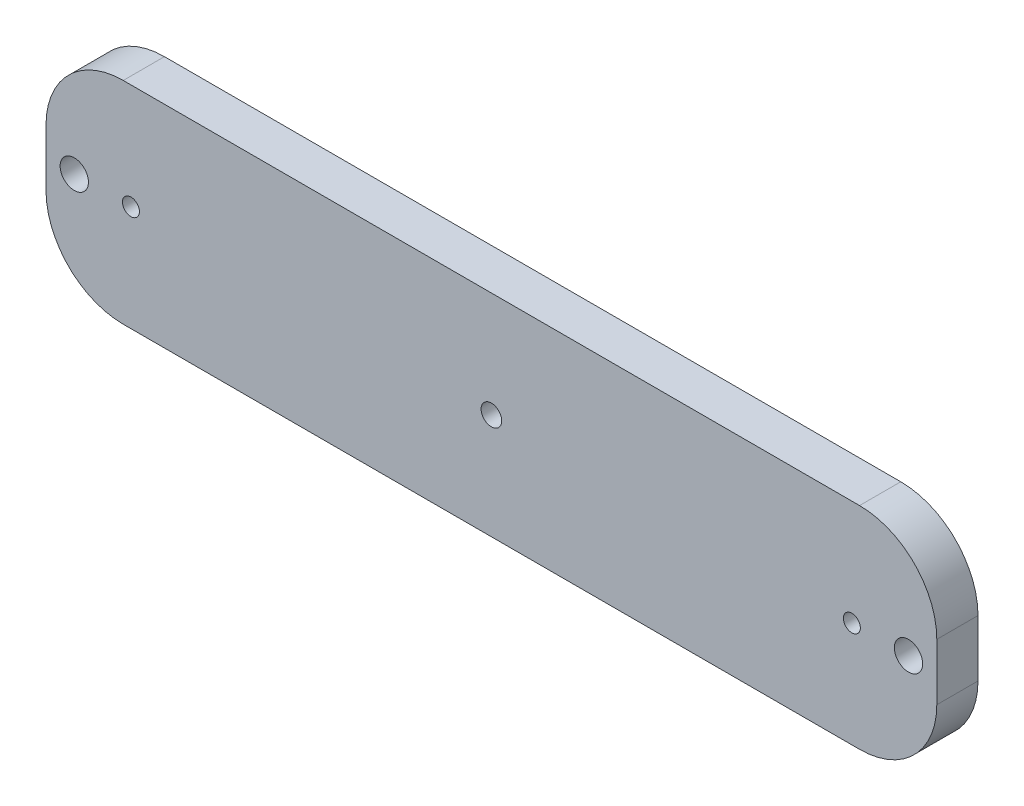
ISO-10303-21;
HEADER;
FILE_DESCRIPTION(('STEP AP214'),'2;1');
FILE_NAME('part.step','',(''),(''),'','','');
FILE_SCHEMA(('AUTOMOTIVE_DESIGN { 1 0 10303 214 1 1 1 1 }'));
ENDSEC;
DATA;
#1=APPLICATION_CONTEXT('core data for automotive mechanical design processes');
#2=APPLICATION_PROTOCOL_DEFINITION('international standard','automotive_design',2000,#1);
#3=PRODUCT_CONTEXT('',#1,'mechanical');
#4=PRODUCT('Part','Part','',(#3));
#5=PRODUCT_RELATED_PRODUCT_CATEGORY('part','',(#4));
#6=PRODUCT_DEFINITION_FORMATION('','',#4);
#7=PRODUCT_DEFINITION_CONTEXT('part definition',#1,'design');
#8=PRODUCT_DEFINITION('design','',#6,#7);
#9=PRODUCT_DEFINITION_SHAPE('','',#8);
#10=(LENGTH_UNIT() NAMED_UNIT(*) SI_UNIT(.MILLI.,.METRE.));
#11=(NAMED_UNIT(*) PLANE_ANGLE_UNIT() SI_UNIT($,.RADIAN.));
#12=(NAMED_UNIT(*) SI_UNIT($,.STERADIAN.) SOLID_ANGLE_UNIT());
#13=UNCERTAINTY_MEASURE_WITH_UNIT(LENGTH_MEASURE(1.E-05),#10,'distance_accuracy_value','');
#14=(GEOMETRIC_REPRESENTATION_CONTEXT(3) GLOBAL_UNCERTAINTY_ASSIGNED_CONTEXT((#13)) GLOBAL_UNIT_ASSIGNED_CONTEXT((#10,
#11,#12)) REPRESENTATION_CONTEXT('',''));
#15=CARTESIAN_POINT('',(0.,0.,0.));
#16=DIRECTION('',(0.,0.,1.));
#17=DIRECTION('',(1.,0.,0.));
#18=AXIS2_PLACEMENT_3D('',#15,#16,#17);
#19=CARTESIAN_POINT('',(138.999999372192,0.,3.));
#20=DIRECTION('',(0.,-1.,0.));
#21=DIRECTION('',(1.,0.,0.));
#22=AXIS2_PLACEMENT_3D('',#19,#20,#21);
#23=PLANE('',#22);
#24=DIRECTION('',(-1.,0.,0.));
#25=VECTOR('',#24,1.);
#26=CARTESIAN_POINT('',(138.999999372192,0.,3.));
#27=LINE('',#26,#25);
#28=CARTESIAN_POINT('',(154.491925357519,0.,3.));
#29=VERTEX_POINT('',#28);
#30=CARTESIAN_POINT('',(11.508074014657,0.,3.));
#31=VERTEX_POINT('',#30);
#32=EDGE_CURVE('E177',#29,#31,#27,.T.);
#33=ORIENTED_EDGE('',*,*,#32,.T.);
#34=DIRECTION('',(0.,0.,1.));
#35=VECTOR('',#34,1.);
#36=CARTESIAN_POINT('',(11.508074014657,0.,3.));
#37=LINE('',#36,#35);
#38=CARTESIAN_POINT('',(11.508074014657,0.,-5.));
#39=VERTEX_POINT('',#38);
#40=EDGE_CURVE('E60',#31,#39,#37,.F.);
#41=ORIENTED_EDGE('',*,*,#40,.T.);
#42=DIRECTION('',(-1.,0.,0.));
#43=VECTOR('',#42,1.);
#44=CARTESIAN_POINT('',(138.999999372192,0.,-5.));
#45=LINE('',#44,#43);
#46=CARTESIAN_POINT('',(154.491925357519,0.,-5.));
#47=VERTEX_POINT('',#46);
#48=EDGE_CURVE('E161',#47,#39,#45,.T.);
#49=ORIENTED_EDGE('',*,*,#48,.F.);
#50=DIRECTION('',(0.,0.,1.));
#51=VECTOR('',#50,1.);
#52=CARTESIAN_POINT('',(154.491925357519,0.,3.));
#53=LINE('',#52,#51);
#54=EDGE_CURVE('E123',#29,#47,#53,.F.);
#55=ORIENTED_EDGE('',*,*,#54,.F.);
#56=EDGE_LOOP('',(#33,#41,#49,#55));
#57=FACE_BOUND('',#56,.T.);
#58=ADVANCED_FACE('F37',(#57),#23,.T.);
#59=CARTESIAN_POINT('',(17.0161480293185,41.,3.));
#60=DIRECTION('',(0.,1.,0.));
#61=DIRECTION('',(-1.,0.,0.));
#62=AXIS2_PLACEMENT_3D('',#59,#60,#61);
#63=PLANE('',#62);
#64=DIRECTION('',(1.,0.,0.));
#65=VECTOR('',#64,1.);
#66=CARTESIAN_POINT('',(17.0161480293185,41.,-5.));
#67=LINE('',#66,#65);
#68=CARTESIAN_POINT('',(11.508074014657,41.,-5.));
#69=VERTEX_POINT('',#68);
#70=CARTESIAN_POINT('',(154.491925357519,41.,-5.));
#71=VERTEX_POINT('',#70);
#72=EDGE_CURVE('E179',#69,#71,#67,.T.);
#73=ORIENTED_EDGE('',*,*,#72,.F.);
#74=DIRECTION('',(0.,0.,1.));
#75=VECTOR('',#74,1.);
#76=CARTESIAN_POINT('',(11.508074014657,41.,3.));
#77=LINE('',#76,#75);
#78=CARTESIAN_POINT('',(11.508074014657,41.,3.));
#79=VERTEX_POINT('',#78);
#80=EDGE_CURVE('E12',#69,#79,#77,.T.);
#81=ORIENTED_EDGE('',*,*,#80,.T.);
#82=DIRECTION('',(1.,0.,0.));
#83=VECTOR('',#82,1.);
#84=CARTESIAN_POINT('',(17.0161480293185,41.,3.));
#85=LINE('',#84,#83);
#86=CARTESIAN_POINT('',(154.491925357519,41.,3.));
#87=VERTEX_POINT('',#86);
#88=EDGE_CURVE('E154',#79,#87,#85,.T.);
#89=ORIENTED_EDGE('',*,*,#88,.T.);
#90=DIRECTION('',(0.,0.,1.));
#91=VECTOR('',#90,1.);
#92=CARTESIAN_POINT('',(154.491925357519,41.,3.));
#93=LINE('',#92,#91);
#94=EDGE_CURVE('E124',#71,#87,#93,.T.);
#95=ORIENTED_EDGE('',*,*,#94,.F.);
#96=EDGE_LOOP('',(#73,#81,#89,#95));
#97=FACE_BOUND('',#96,.T.);
#98=ADVANCED_FACE('F209',(#97),#63,.T.);
#99=CARTESIAN_POINT('',(0.,0.,-5.));
#100=DIRECTION('',(0.,0.,1.));
#101=DIRECTION('',(1.,0.,0.));
#102=AXIS2_PLACEMENT_3D('',#99,#100,#101);
#103=PLANE('',#102);
#104=ORIENTED_EDGE('',*,*,#72,.T.);
#105=CARTESIAN_POINT('',(154.491925357519,26.,-5.));
#106=DIRECTION('',(0.,0.,-1.));
#107=DIRECTION('',(-1.,0.,0.));
#108=AXIS2_PLACEMENT_3D('',#105,#106,#107);
#109=CIRCLE('',#108,15.);
#110=CARTESIAN_POINT('',(169.491925357519,26.,-5.));
#111=VERTEX_POINT('',#110);
#112=EDGE_CURVE('E125',#111,#71,#109,.F.);
#113=ORIENTED_EDGE('',*,*,#112,.F.);
#114=DIRECTION('',(0.,1.,0.));
#115=VECTOR('',#114,1.);
#116=CARTESIAN_POINT('',(169.491925357519,-22.0132028517169,-5.));
#117=LINE('',#116,#115);
#118=CARTESIAN_POINT('',(169.491925357519,15.,-5.));
#119=VERTEX_POINT('',#118);
#120=EDGE_CURVE('E108',#119,#111,#117,.T.);
#121=ORIENTED_EDGE('',*,*,#120,.F.);
#122=CARTESIAN_POINT('',(154.491925357519,15.,-5.));
#123=DIRECTION('',(0.,0.,-1.));
#124=DIRECTION('',(-1.,0.,0.));
#125=AXIS2_PLACEMENT_3D('',#122,#123,#124);
#126=CIRCLE('',#125,15.);
#127=EDGE_CURVE('E120',#47,#119,#126,.F.);
#128=ORIENTED_EDGE('',*,*,#127,.F.);
#129=ORIENTED_EDGE('',*,*,#48,.T.);
#130=CARTESIAN_POINT('',(11.508074014657,15.,-5.));
#131=DIRECTION('',(0.,0.,1.));
#132=DIRECTION('',(1.,0.,0.));
#133=AXIS2_PLACEMENT_3D('',#130,#131,#132);
#134=CIRCLE('',#133,15.);
#135=CARTESIAN_POINT('',(-3.49192598534301,15.,-5.));
#136=VERTEX_POINT('',#135);
#137=EDGE_CURVE('E45',#39,#136,#134,.F.);
#138=ORIENTED_EDGE('',*,*,#137,.T.);
#139=DIRECTION('',(0.,1.,0.));
#140=VECTOR('',#139,1.);
#141=CARTESIAN_POINT('',(-3.49192598534301,-22.0132028517169,-5.));
#142=LINE('',#141,#140);
#143=CARTESIAN_POINT('',(-3.49192598534301,26.,-5.));
#144=VERTEX_POINT('',#143);
#145=EDGE_CURVE('E155',#136,#144,#142,.T.);
#146=ORIENTED_EDGE('',*,*,#145,.T.);
#147=CARTESIAN_POINT('',(11.508074014657,26.,-5.));
#148=DIRECTION('',(0.,0.,1.));
#149=DIRECTION('',(1.,0.,0.));
#150=AXIS2_PLACEMENT_3D('',#147,#148,#149);
#151=CIRCLE('',#150,15.);
#152=EDGE_CURVE('E52',#144,#69,#151,.F.);
#153=ORIENTED_EDGE('',*,*,#152,.T.);
#154=EDGE_LOOP('',(#104,#113,#121,#128,#129,#138,#146,#153));
#155=FACE_BOUND('',#154,.T.);
#156=CARTESIAN_POINT('',(1.99999968609549,20.4919259853408,-5.));
#157=DIRECTION('',(0.,0.,1.));
#158=DIRECTION('',(1.,0.,0.));
#159=AXIS2_PLACEMENT_3D('',#156,#157,#158);
#160=CIRCLE('',#159,2.75);
#161=CARTESIAN_POINT('',(4.74999968609549,20.4919259853408,-5.));
#162=VERTEX_POINT('',#161);
#163=EDGE_CURVE('E157',#162,#162,#160,.T.);
#164=ORIENTED_EDGE('',*,*,#163,.T.);
#165=EDGE_LOOP('',(#164));
#166=FACE_BOUND('',#165,.T.);
#167=CARTESIAN_POINT('',(12.9999997502427,20.4919259853408,-5.));
#168=DIRECTION('',(0.,0.,1.));
#169=DIRECTION('',(1.,0.,0.));
#170=AXIS2_PLACEMENT_3D('',#167,#168,#169);
#171=CIRCLE('',#170,1.65);
#172=CARTESIAN_POINT('',(14.6499997502427,20.4919259853408,-5.));
#173=VERTEX_POINT('',#172);
#174=EDGE_CURVE('E168',#173,#173,#171,.T.);
#175=ORIENTED_EDGE('',*,*,#174,.T.);
#176=EDGE_LOOP('',(#175));
#177=FACE_BOUND('',#176,.T.);
#178=CARTESIAN_POINT('',(82.9999996860881,20.4919259853408,-5.));
#179=DIRECTION('',(0.,0.,1.));
#180=DIRECTION('',(1.,0.,0.));
#181=AXIS2_PLACEMENT_3D('',#178,#179,#180);
#182=CIRCLE('',#181,2.);
#183=CARTESIAN_POINT('',(84.9999996860881,20.4919259853408,-5.));
#184=VERTEX_POINT('',#183);
#185=EDGE_CURVE('E167',#184,#184,#182,.T.);
#186=ORIENTED_EDGE('',*,*,#185,.T.);
#187=EDGE_LOOP('',(#186));
#188=FACE_BOUND('',#187,.T.);
#189=CARTESIAN_POINT('',(163.999999686081,20.4919259853408,-5.));
#190=DIRECTION('',(0.,0.,-1.));
#191=DIRECTION('',(-1.,0.,0.));
#192=AXIS2_PLACEMENT_3D('',#189,#190,#191);
#193=CIRCLE('',#192,2.75);
#194=CARTESIAN_POINT('',(161.249999686081,20.4919259853408,-5.));
#195=VERTEX_POINT('',#194);
#196=EDGE_CURVE('E130',#195,#195,#193,.T.);
#197=ORIENTED_EDGE('',*,*,#196,.F.);
#198=EDGE_LOOP('',(#197));
#199=FACE_BOUND('',#198,.T.);
#200=CARTESIAN_POINT('',(152.999999621933,20.4919259853408,-5.));
#201=DIRECTION('',(0.,0.,-1.));
#202=DIRECTION('',(-1.,0.,0.));
#203=AXIS2_PLACEMENT_3D('',#200,#201,#202);
#204=CIRCLE('',#203,1.65);
#205=CARTESIAN_POINT('',(151.349999621933,20.4919259853408,-5.));
#206=VERTEX_POINT('',#205);
#207=EDGE_CURVE('E139',#206,#206,#204,.T.);
#208=ORIENTED_EDGE('',*,*,#207,.F.);
#209=EDGE_LOOP('',(#208));
#210=FACE_BOUND('',#209,.T.);
#211=ADVANCED_FACE('F127',(#155,#166,#177,#188,#199,#210),#103,.F.);
#212=CARTESIAN_POINT('',(0.,0.,3.));
#213=DIRECTION('',(0.,0.,1.));
#214=DIRECTION('',(1.,0.,0.));
#215=AXIS2_PLACEMENT_3D('',#212,#213,#214);
#216=PLANE('',#215);
#217=CARTESIAN_POINT('',(154.491925357519,26.,3.));
#218=DIRECTION('',(0.,0.,-1.));
#219=DIRECTION('',(-1.,0.,0.));
#220=AXIS2_PLACEMENT_3D('',#217,#218,#219);
#221=CIRCLE('',#220,15.);
#222=CARTESIAN_POINT('',(169.491925357519,26.,3.));
#223=VERTEX_POINT('',#222);
#224=EDGE_CURVE('E115',#87,#223,#221,.T.);
#225=ORIENTED_EDGE('',*,*,#224,.F.);
#226=ORIENTED_EDGE('',*,*,#88,.F.);
#227=CARTESIAN_POINT('',(11.508074014657,26.,3.));
#228=DIRECTION('',(0.,0.,1.));
#229=DIRECTION('',(1.,0.,0.));
#230=AXIS2_PLACEMENT_3D('',#227,#228,#229);
#231=CIRCLE('',#230,15.);
#232=CARTESIAN_POINT('',(-3.49192598534301,26.,3.));
#233=VERTEX_POINT('',#232);
#234=EDGE_CURVE('E190',#79,#233,#231,.T.);
#235=ORIENTED_EDGE('',*,*,#234,.T.);
#236=DIRECTION('',(0.,1.,0.));
#237=VECTOR('',#236,1.);
#238=CARTESIAN_POINT('',(-3.49192598534301,-22.0132028517169,3.));
#239=LINE('',#238,#237);
#240=CARTESIAN_POINT('',(-3.49192598534301,15.,3.));
#241=VERTEX_POINT('',#240);
#242=EDGE_CURVE('E158',#241,#233,#239,.T.);
#243=ORIENTED_EDGE('',*,*,#242,.F.);
#244=CARTESIAN_POINT('',(11.508074014657,15.,3.));
#245=DIRECTION('',(0.,0.,1.));
#246=DIRECTION('',(1.,0.,0.));
#247=AXIS2_PLACEMENT_3D('',#244,#245,#246);
#248=CIRCLE('',#247,15.);
#249=EDGE_CURVE('E192',#241,#31,#248,.T.);
#250=ORIENTED_EDGE('',*,*,#249,.T.);
#251=ORIENTED_EDGE('',*,*,#32,.F.);
#252=CARTESIAN_POINT('',(154.491925357519,15.,3.));
#253=DIRECTION('',(0.,0.,-1.));
#254=DIRECTION('',(-1.,0.,0.));
#255=AXIS2_PLACEMENT_3D('',#252,#253,#254);
#256=CIRCLE('',#255,15.);
#257=CARTESIAN_POINT('',(169.491925357519,15.,3.));
#258=VERTEX_POINT('',#257);
#259=EDGE_CURVE('E148',#258,#29,#256,.T.);
#260=ORIENTED_EDGE('',*,*,#259,.F.);
#261=DIRECTION('',(0.,1.,0.));
#262=VECTOR('',#261,1.);
#263=CARTESIAN_POINT('',(169.491925357519,-22.0132028517169,3.));
#264=LINE('',#263,#262);
#265=EDGE_CURVE('E111',#258,#223,#264,.T.);
#266=ORIENTED_EDGE('',*,*,#265,.T.);
#267=EDGE_LOOP('',(#225,#226,#235,#243,#250,#251,#260,#266));
#268=FACE_BOUND('',#267,.T.);
#269=CARTESIAN_POINT('',(1.99999968609549,20.4919259853408,3.));
#270=DIRECTION('',(0.,0.,1.));
#271=DIRECTION('',(1.,0.,0.));
#272=AXIS2_PLACEMENT_3D('',#269,#270,#271);
#273=CIRCLE('',#272,2.74999999999999);
#274=CARTESIAN_POINT('',(4.74999968609548,20.4919259853408,3.));
#275=VERTEX_POINT('',#274);
#276=EDGE_CURVE('E164',#275,#275,#273,.T.);
#277=ORIENTED_EDGE('',*,*,#276,.F.);
#278=EDGE_LOOP('',(#277));
#279=FACE_BOUND('',#278,.T.);
#280=CARTESIAN_POINT('',(12.9999997502427,20.4919259853408,3.));
#281=DIRECTION('',(0.,0.,1.));
#282=DIRECTION('',(1.,0.,0.));
#283=AXIS2_PLACEMENT_3D('',#280,#281,#282);
#284=CIRCLE('',#283,1.64999999999999);
#285=CARTESIAN_POINT('',(14.6499997502427,20.4919259853408,3.));
#286=VERTEX_POINT('',#285);
#287=EDGE_CURVE('E171',#286,#286,#284,.T.);
#288=ORIENTED_EDGE('',*,*,#287,.F.);
#289=EDGE_LOOP('',(#288));
#290=FACE_BOUND('',#289,.T.);
#291=CARTESIAN_POINT('',(82.9999996860881,20.4919259853408,3.));
#292=DIRECTION('',(0.,0.,1.));
#293=DIRECTION('',(1.,0.,0.));
#294=AXIS2_PLACEMENT_3D('',#291,#292,#293);
#295=CIRCLE('',#294,1.99999999999999);
#296=CARTESIAN_POINT('',(84.9999996860881,20.4919259853408,3.));
#297=VERTEX_POINT('',#296);
#298=EDGE_CURVE('E172',#297,#297,#295,.T.);
#299=ORIENTED_EDGE('',*,*,#298,.F.);
#300=EDGE_LOOP('',(#299));
#301=FACE_BOUND('',#300,.T.);
#302=CARTESIAN_POINT('',(163.999999686081,20.4919259853408,3.));
#303=DIRECTION('',(0.,0.,-1.));
#304=DIRECTION('',(-1.,0.,0.));
#305=AXIS2_PLACEMENT_3D('',#302,#303,#304);
#306=CIRCLE('',#305,2.74999999999999);
#307=CARTESIAN_POINT('',(161.249999686081,20.4919259853408,3.));
#308=VERTEX_POINT('',#307);
#309=EDGE_CURVE('E133',#308,#308,#306,.T.);
#310=ORIENTED_EDGE('',*,*,#309,.T.);
#311=EDGE_LOOP('',(#310));
#312=FACE_BOUND('',#311,.T.);
#313=CARTESIAN_POINT('',(152.999999621933,20.4919259853408,3.));
#314=DIRECTION('',(0.,0.,-1.));
#315=DIRECTION('',(-1.,0.,0.));
#316=AXIS2_PLACEMENT_3D('',#313,#314,#315);
#317=CIRCLE('',#316,1.64999999999999);
#318=CARTESIAN_POINT('',(151.349999621933,20.4919259853408,3.));
#319=VERTEX_POINT('',#318);
#320=EDGE_CURVE('E142',#319,#319,#317,.T.);
#321=ORIENTED_EDGE('',*,*,#320,.T.);
#322=EDGE_LOOP('',(#321));
#323=FACE_BOUND('',#322,.T.);
#324=ADVANCED_FACE('F206',(#268,#279,#290,#301,#312,#323),#216,.T.);
#325=CARTESIAN_POINT('',(82.9999996860881,20.4919259853408,3.));
#326=DIRECTION('',(0.,0.,1.));
#327=DIRECTION('',(1.,0.,0.));
#328=AXIS2_PLACEMENT_3D('',#325,#326,#327);
#329=CYLINDRICAL_SURFACE('',#328,1.99999999999999);
#330=ORIENTED_EDGE('',*,*,#185,.F.);
#331=EDGE_LOOP('',(#330));
#332=FACE_BOUND('',#331,.T.);
#333=ORIENTED_EDGE('',*,*,#298,.T.);
#334=EDGE_LOOP('',(#333));
#335=FACE_BOUND('',#334,.T.);
#336=ADVANCED_FACE('F222',(#332,#335),#329,.F.);
#337=CARTESIAN_POINT('',(-3.49192598534301,-22.0132028517169,-5.));
#338=DIRECTION('',(-1.,0.,0.));
#339=DIRECTION('',(0.,-1.,0.));
#340=AXIS2_PLACEMENT_3D('',#337,#338,#339);
#341=PLANE('',#340);
#342=ORIENTED_EDGE('',*,*,#145,.F.);
#343=DIRECTION('',(0.,0.,1.));
#344=VECTOR('',#343,1.);
#345=CARTESIAN_POINT('',(-3.49192598534301,15.,-5.));
#346=LINE('',#345,#344);
#347=EDGE_CURVE('E187',#136,#241,#346,.T.);
#348=ORIENTED_EDGE('',*,*,#347,.T.);
#349=ORIENTED_EDGE('',*,*,#242,.T.);
#350=DIRECTION('',(0.,0.,1.));
#351=VECTOR('',#350,1.);
#352=CARTESIAN_POINT('',(-3.49192598534301,26.,-5.));
#353=LINE('',#352,#351);
#354=EDGE_CURVE('E175',#233,#144,#353,.F.);
#355=ORIENTED_EDGE('',*,*,#354,.T.);
#356=EDGE_LOOP('',(#342,#348,#349,#355));
#357=FACE_BOUND('',#356,.T.);
#358=ADVANCED_FACE('F200',(#357),#341,.T.);
#359=CARTESIAN_POINT('',(1.99999968609549,20.4919259853408,3.));
#360=DIRECTION('',(0.,0.,1.));
#361=DIRECTION('',(1.,0.,0.));
#362=AXIS2_PLACEMENT_3D('',#359,#360,#361);
#363=CYLINDRICAL_SURFACE('',#362,2.74999999999999);
#364=ORIENTED_EDGE('',*,*,#163,.F.);
#365=EDGE_LOOP('',(#364));
#366=FACE_BOUND('',#365,.T.);
#367=ORIENTED_EDGE('',*,*,#276,.T.);
#368=EDGE_LOOP('',(#367));
#369=FACE_BOUND('',#368,.T.);
#370=ADVANCED_FACE('F225',(#366,#369),#363,.F.);
#371=CARTESIAN_POINT('',(12.9999997502427,20.4919259853408,3.));
#372=DIRECTION('',(0.,0.,1.));
#373=DIRECTION('',(1.,0.,0.));
#374=AXIS2_PLACEMENT_3D('',#371,#372,#373);
#375=CYLINDRICAL_SURFACE('',#374,1.64999999999999);
#376=ORIENTED_EDGE('',*,*,#174,.F.);
#377=EDGE_LOOP('',(#376));
#378=FACE_BOUND('',#377,.T.);
#379=ORIENTED_EDGE('',*,*,#287,.T.);
#380=EDGE_LOOP('',(#379));
#381=FACE_BOUND('',#380,.T.);
#382=ADVANCED_FACE('F227',(#378,#381),#375,.F.);
#383=CARTESIAN_POINT('',(11.508074014657,15.,-5.));
#384=DIRECTION('',(0.,0.,1.));
#385=DIRECTION('',(1.,0.,0.));
#386=AXIS2_PLACEMENT_3D('',#383,#384,#385);
#387=CYLINDRICAL_SURFACE('',#386,15.);
#388=ORIENTED_EDGE('',*,*,#137,.F.);
#389=ORIENTED_EDGE('',*,*,#40,.F.);
#390=ORIENTED_EDGE('',*,*,#249,.F.);
#391=ORIENTED_EDGE('',*,*,#347,.F.);
#392=EDGE_LOOP('',(#388,#389,#390,#391));
#393=FACE_BOUND('',#392,.T.);
#394=ADVANCED_FACE('F203',(#393),#387,.T.);
#395=CARTESIAN_POINT('',(11.508074014657,26.,3.));
#396=DIRECTION('',(0.,0.,1.));
#397=DIRECTION('',(1.,0.,0.));
#398=AXIS2_PLACEMENT_3D('',#395,#396,#397);
#399=CYLINDRICAL_SURFACE('',#398,15.);
#400=ORIENTED_EDGE('',*,*,#152,.F.);
#401=ORIENTED_EDGE('',*,*,#354,.F.);
#402=ORIENTED_EDGE('',*,*,#234,.F.);
#403=ORIENTED_EDGE('',*,*,#80,.F.);
#404=EDGE_LOOP('',(#400,#401,#402,#403));
#405=FACE_BOUND('',#404,.T.);
#406=ADVANCED_FACE('F39',(#405),#399,.T.);
#407=CARTESIAN_POINT('',(169.491925357519,-22.0132028517169,-5.));
#408=DIRECTION('',(1.,0.,0.));
#409=DIRECTION('',(0.,-1.,0.));
#410=AXIS2_PLACEMENT_3D('',#407,#408,#409);
#411=PLANE('',#410);
#412=ORIENTED_EDGE('',*,*,#120,.T.);
#413=DIRECTION('',(0.,0.,1.));
#414=VECTOR('',#413,1.);
#415=CARTESIAN_POINT('',(169.491925357519,26.,-5.));
#416=LINE('',#415,#414);
#417=EDGE_CURVE('E116',#223,#111,#416,.F.);
#418=ORIENTED_EDGE('',*,*,#417,.F.);
#419=ORIENTED_EDGE('',*,*,#265,.F.);
#420=DIRECTION('',(0.,0.,1.));
#421=VECTOR('',#420,1.);
#422=CARTESIAN_POINT('',(169.491925357519,15.,-5.));
#423=LINE('',#422,#421);
#424=EDGE_CURVE('E104',#119,#258,#423,.T.);
#425=ORIENTED_EDGE('',*,*,#424,.F.);
#426=EDGE_LOOP('',(#412,#418,#419,#425));
#427=FACE_BOUND('',#426,.T.);
#428=ADVANCED_FACE('F106',(#427),#411,.T.);
#429=CARTESIAN_POINT('',(163.999999686081,20.4919259853408,3.));
#430=DIRECTION('',(0.,0.,1.));
#431=DIRECTION('',(-1.,0.,0.));
#432=AXIS2_PLACEMENT_3D('',#429,#430,#431);
#433=CYLINDRICAL_SURFACE('',#432,2.74999999999999);
#434=ORIENTED_EDGE('',*,*,#196,.T.);
#435=EDGE_LOOP('',(#434));
#436=FACE_BOUND('',#435,.T.);
#437=ORIENTED_EDGE('',*,*,#309,.F.);
#438=EDGE_LOOP('',(#437));
#439=FACE_BOUND('',#438,.T.);
#440=ADVANCED_FACE('F255',(#436,#439),#433,.F.);
#441=CARTESIAN_POINT('',(152.999999621933,20.4919259853408,3.));
#442=DIRECTION('',(0.,0.,1.));
#443=DIRECTION('',(-1.,0.,0.));
#444=AXIS2_PLACEMENT_3D('',#441,#442,#443);
#445=CYLINDRICAL_SURFACE('',#444,1.64999999999999);
#446=ORIENTED_EDGE('',*,*,#207,.T.);
#447=EDGE_LOOP('',(#446));
#448=FACE_BOUND('',#447,.T.);
#449=ORIENTED_EDGE('',*,*,#320,.F.);
#450=EDGE_LOOP('',(#449));
#451=FACE_BOUND('',#450,.T.);
#452=ADVANCED_FACE('F252',(#448,#451),#445,.F.);
#453=CARTESIAN_POINT('',(154.491925357519,15.,-5.));
#454=DIRECTION('',(0.,0.,1.));
#455=DIRECTION('',(-1.,0.,0.));
#456=AXIS2_PLACEMENT_3D('',#453,#454,#455);
#457=CYLINDRICAL_SURFACE('',#456,15.);
#458=ORIENTED_EDGE('',*,*,#127,.T.);
#459=ORIENTED_EDGE('',*,*,#424,.T.);
#460=ORIENTED_EDGE('',*,*,#259,.T.);
#461=ORIENTED_EDGE('',*,*,#54,.T.);
#462=EDGE_LOOP('',(#458,#459,#460,#461));
#463=FACE_BOUND('',#462,.T.);
#464=ADVANCED_FACE('F121',(#463),#457,.T.);
#465=CARTESIAN_POINT('',(154.491925357519,26.,3.));
#466=DIRECTION('',(0.,0.,1.));
#467=DIRECTION('',(-1.,0.,0.));
#468=AXIS2_PLACEMENT_3D('',#465,#466,#467);
#469=CYLINDRICAL_SURFACE('',#468,15.);
#470=ORIENTED_EDGE('',*,*,#112,.T.);
#471=ORIENTED_EDGE('',*,*,#94,.T.);
#472=ORIENTED_EDGE('',*,*,#224,.T.);
#473=ORIENTED_EDGE('',*,*,#417,.T.);
#474=EDGE_LOOP('',(#470,#471,#472,#473));
#475=FACE_BOUND('',#474,.T.);
#476=ADVANCED_FACE('F246',(#475),#469,.T.);
#477=CLOSED_SHELL('',(#58,#98,#211,#324,#336,#358,#370,#382,#394,#406,#428,#440,#452,#464,#476));
#478=MANIFOLD_SOLID_BREP('B2',#477);
#479=ADVANCED_BREP_SHAPE_REPRESENTATION('',(#18,#478),#14);
#480=SHAPE_DEFINITION_REPRESENTATION(#9,#479);
ENDSEC;
END-ISO-10303-21;
